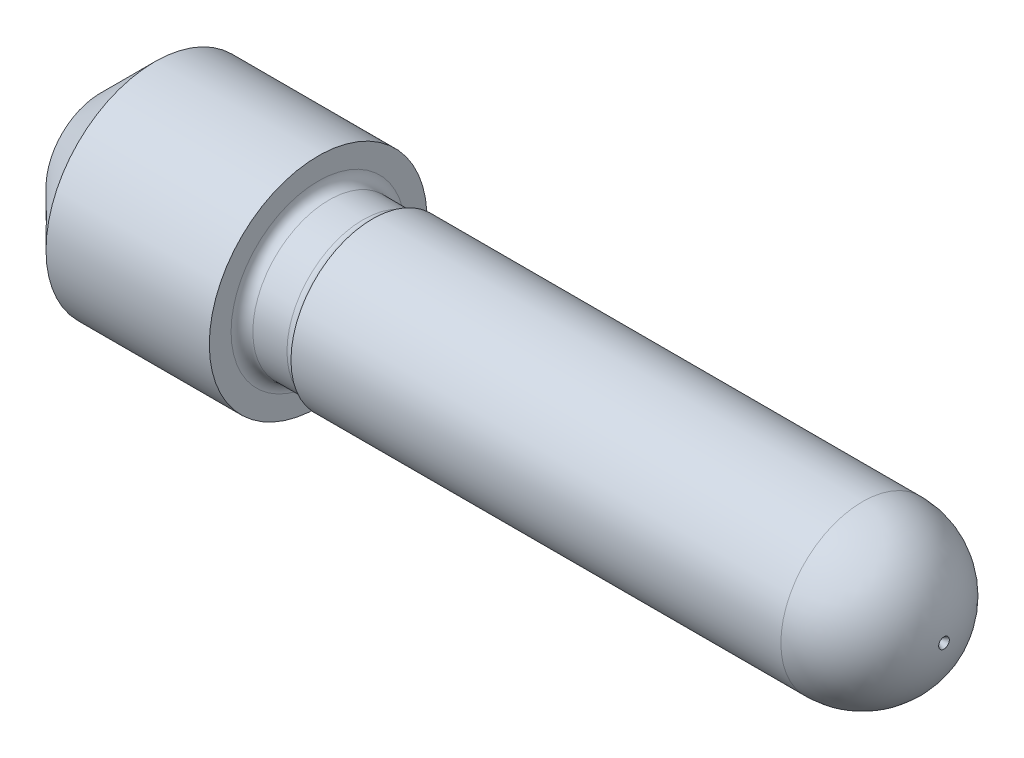
ISO-10303-21;
HEADER;
FILE_DESCRIPTION(('STEP AP214'),'2;1');
FILE_NAME('part.step','',(''),(''),'','','');
FILE_SCHEMA(('AUTOMOTIVE_DESIGN { 1 0 10303 214 1 1 1 1 }'));
ENDSEC;
DATA;
#1=APPLICATION_CONTEXT('core data for automotive mechanical design processes');
#2=APPLICATION_PROTOCOL_DEFINITION('international standard','automotive_design',2000,#1);
#3=PRODUCT_CONTEXT('',#1,'mechanical');
#4=PRODUCT('Part','Part','',(#3));
#5=PRODUCT_RELATED_PRODUCT_CATEGORY('part','',(#4));
#6=PRODUCT_DEFINITION_FORMATION('','',#4);
#7=PRODUCT_DEFINITION_CONTEXT('part definition',#1,'design');
#8=PRODUCT_DEFINITION('design','',#6,#7);
#9=PRODUCT_DEFINITION_SHAPE('','',#8);
#10=(LENGTH_UNIT() NAMED_UNIT(*) SI_UNIT(.MILLI.,.METRE.));
#11=(NAMED_UNIT(*) PLANE_ANGLE_UNIT() SI_UNIT($,.RADIAN.));
#12=(NAMED_UNIT(*) SI_UNIT($,.STERADIAN.) SOLID_ANGLE_UNIT());
#13=UNCERTAINTY_MEASURE_WITH_UNIT(LENGTH_MEASURE(1.E-05),#10,'distance_accuracy_value','');
#14=(GEOMETRIC_REPRESENTATION_CONTEXT(3) GLOBAL_UNCERTAINTY_ASSIGNED_CONTEXT((#13)) GLOBAL_UNIT_ASSIGNED_CONTEXT((#10,
#11,#12)) REPRESENTATION_CONTEXT('',''));
#15=CARTESIAN_POINT('',(0.,0.,0.));
#16=DIRECTION('',(0.,0.,1.));
#17=DIRECTION('',(1.,0.,0.));
#18=AXIS2_PLACEMENT_3D('',#15,#16,#17);
#19=CARTESIAN_POINT('',(-4.0000000000191,0.,0.));
#20=DIRECTION('',(-1.,0.,0.));
#21=DIRECTION('',(0.,0.,1.));
#22=AXIS2_PLACEMENT_3D('',#19,#20,#21);
#23=CONICAL_SURFACE('',#22,0.100000000031741,0.523598775666574);
#24=CARTESIAN_POINT('',(-3.82679491934823,0.,0.));
#25=VERTEX_POINT('',#24);
#26=VERTEX_LOOP('',#25);
#27=FACE_BOUND('',#26,.T.);
#28=CARTESIAN_POINT('',(-4.0000000000191,0.,0.));
#29=DIRECTION('',(-1.,0.,0.));
#30=DIRECTION('',(0.,0.,1.));
#31=AXIS2_PLACEMENT_3D('',#28,#29,#30);
#32=CIRCLE('',#31,0.100000000031741);
#33=CARTESIAN_POINT('',(-4.0000000000191,0.,0.100000000031741));
#34=VERTEX_POINT('',#33);
#35=EDGE_CURVE('E58',#34,#34,#32,.T.);
#36=ORIENTED_EDGE('',*,*,#35,.T.);
#37=EDGE_LOOP('',(#36));
#38=FACE_BOUND('',#37,.T.);
#39=ADVANCED_FACE('F17',(#27,#38),#23,.F.);
#40=CARTESIAN_POINT('',(-4.,0.,0.));
#41=DIRECTION('',(1.,0.,0.));
#42=DIRECTION('',(0.,0.,-1.));
#43=AXIS2_PLACEMENT_3D('',#40,#41,#42);
#44=PLANE('',#43);
#45=ORIENTED_EDGE('',*,*,#35,.F.);
#46=EDGE_LOOP('',(#45));
#47=FACE_BOUND('',#46,.T.);
#48=CARTESIAN_POINT('',(-4.0000000000191,0.,0.));
#49=DIRECTION('',(1.,0.,0.));
#50=DIRECTION('',(0.,0.,-1.));
#51=AXIS2_PLACEMENT_3D('',#48,#49,#50);
#52=CIRCLE('',#51,0.999999999976353);
#53=CARTESIAN_POINT('',(-4.0000000000191,0.,-0.999999999976353));
#54=VERTEX_POINT('',#53);
#55=EDGE_CURVE('E60',#54,#54,#52,.T.);
#56=ORIENTED_EDGE('',*,*,#55,.F.);
#57=EDGE_LOOP('',(#56));
#58=FACE_BOUND('',#57,.T.);
#59=ADVANCED_FACE('F55',(#47,#58),#44,.F.);
#60=CARTESIAN_POINT('',(-2.9999999999859,0.,0.));
#61=DIRECTION('',(1.,0.,0.));
#62=DIRECTION('',(0.,0.,-1.));
#63=AXIS2_PLACEMENT_3D('',#60,#61,#62);
#64=CONICAL_SURFACE('',#63,1.99999999995271,0.785398163369027);
#65=ORIENTED_EDGE('',*,*,#55,.T.);
#66=EDGE_LOOP('',(#65));
#67=FACE_BOUND('',#66,.T.);
#68=CARTESIAN_POINT('',(-3.,0.,0.));
#69=DIRECTION('',(-1.,0.,0.));
#70=DIRECTION('',(0.,0.,1.));
#71=AXIS2_PLACEMENT_3D('',#68,#69,#70);
#72=CIRCLE('',#71,2.);
#73=CARTESIAN_POINT('',(-3.,0.,2.));
#74=VERTEX_POINT('',#73);
#75=EDGE_CURVE('E63',#74,#74,#72,.F.);
#76=ORIENTED_EDGE('',*,*,#75,.F.);
#77=EDGE_LOOP('',(#76));
#78=FACE_BOUND('',#77,.T.);
#79=ADVANCED_FACE('F207',(#67,#78),#64,.T.);
#80=CARTESIAN_POINT('',(0.,0.,0.));
#81=DIRECTION('',(-1.,0.,0.));
#82=DIRECTION('',(0.,0.,1.));
#83=AXIS2_PLACEMENT_3D('',#80,#81,#82);
#84=CYLINDRICAL_SURFACE('',#83,2.);
#85=CARTESIAN_POINT('',(0.,0.,0.));
#86=DIRECTION('',(-1.,0.,0.));
#87=DIRECTION('',(0.,0.,1.));
#88=AXIS2_PLACEMENT_3D('',#85,#86,#87);
#89=CIRCLE('',#88,2.);
#90=CARTESIAN_POINT('',(0.,0.,2.));
#91=VERTEX_POINT('',#90);
#92=EDGE_CURVE('E113',#91,#91,#89,.T.);
#93=ORIENTED_EDGE('',*,*,#92,.T.);
#94=EDGE_LOOP('',(#93));
#95=FACE_BOUND('',#94,.T.);
#96=ORIENTED_EDGE('',*,*,#75,.T.);
#97=EDGE_LOOP('',(#96));
#98=FACE_BOUND('',#97,.T.);
#99=ADVANCED_FACE('F199',(#95,#98),#84,.T.);
#100=CARTESIAN_POINT('',(0.,7.,0.));
#101=DIRECTION('',(-1.,0.,0.));
#102=DIRECTION('',(0.,0.,1.));
#103=AXIS2_PLACEMENT_3D('',#100,#101,#102);
#104=PLANE('',#103);
#105=CARTESIAN_POINT('',(0.,0.,0.));
#106=DIRECTION('',(1.,0.,0.));
#107=DIRECTION('',(0.,0.,1.));
#108=AXIS2_PLACEMENT_3D('',#105,#106,#107);
#109=CIRCLE('',#108,1.6);
#110=CARTESIAN_POINT('',(0.,0.,1.6));
#111=VERTEX_POINT('',#110);
#112=CARTESIAN_POINT('',(0.,0.,-1.6));
#113=VERTEX_POINT('',#112);
#114=EDGE_CURVE('E48',#111,#113,#109,.T.);
#115=ORIENTED_EDGE('',*,*,#114,.F.);
#116=CARTESIAN_POINT('',(0.,0.,0.));
#117=DIRECTION('',(1.,0.,0.));
#118=DIRECTION('',(0.,0.,-1.));
#119=AXIS2_PLACEMENT_3D('',#116,#117,#118);
#120=CIRCLE('',#119,1.6);
#121=EDGE_CURVE('E69',#111,#113,#120,.F.);
#122=ORIENTED_EDGE('',*,*,#121,.T.);
#123=EDGE_LOOP('',(#115,#122));
#124=FACE_BOUND('',#123,.T.);
#125=ORIENTED_EDGE('',*,*,#92,.F.);
#126=EDGE_LOOP('',(#125));
#127=FACE_BOUND('',#126,.T.);
#128=ADVANCED_FACE('F84',(#124,#127),#104,.F.);
#129=CARTESIAN_POINT('',(0.2,0.,0.));
#130=DIRECTION('',(1.,0.,0.));
#131=DIRECTION('',(0.,0.,-1.));
#132=AXIS2_PLACEMENT_3D('',#129,#130,#131);
#133=TOROIDAL_SURFACE('',#132,1.6,0.2);
#134=ORIENTED_EDGE('',*,*,#114,.T.);
#135=ORIENTED_EDGE('',*,*,#121,.F.);
#136=EDGE_LOOP('',(#134,#135));
#137=FACE_BOUND('',#136,.T.);
#138=CARTESIAN_POINT('',(0.199999999999999,0.,0.));
#139=DIRECTION('',(-1.,0.,0.));
#140=DIRECTION('',(0.,0.,1.));
#141=AXIS2_PLACEMENT_3D('',#138,#139,#140);
#142=CIRCLE('',#141,1.4);
#143=CARTESIAN_POINT('',(0.199999999999999,0.,1.4));
#144=VERTEX_POINT('',#143);
#145=EDGE_CURVE('E91',#144,#144,#142,.F.);
#146=ORIENTED_EDGE('',*,*,#145,.F.);
#147=EDGE_LOOP('',(#146));
#148=FACE_BOUND('',#147,.T.);
#149=ADVANCED_FACE('F72',(#137,#148),#133,.F.);
#150=CARTESIAN_POINT('',(50.,0.,0.));
#151=DIRECTION('',(-1.,0.,0.));
#152=DIRECTION('',(0.,0.,1.));
#153=AXIS2_PLACEMENT_3D('',#150,#151,#152);
#154=CYLINDRICAL_SURFACE('',#153,1.4);
#155=CARTESIAN_POINT('',(0.8267949192431,0.,0.));
#156=DIRECTION('',(1.,0.,0.));
#157=DIRECTION('',(0.,0.,-1.));
#158=AXIS2_PLACEMENT_3D('',#155,#156,#157);
#159=CIRCLE('',#158,1.4);
#160=CARTESIAN_POINT('',(0.8267949192431,0.,-1.4));
#161=VERTEX_POINT('',#160);
#162=EDGE_CURVE('E117',#161,#161,#159,.F.);
#163=ORIENTED_EDGE('',*,*,#162,.T.);
#164=EDGE_LOOP('',(#163));
#165=FACE_BOUND('',#164,.T.);
#166=ORIENTED_EDGE('',*,*,#145,.T.);
#167=EDGE_LOOP('',(#166));
#168=FACE_BOUND('',#167,.T.);
#169=ADVANCED_FACE('F83',(#165,#168),#154,.T.);
#170=CARTESIAN_POINT('',(11.4967857900865,0.,0.));
#171=DIRECTION('',(1.,0.,0.));
#172=DIRECTION('',(0.,0.,-1.));
#173=AXIS2_PLACEMENT_3D('',#170,#171,#172);
#174=CONICAL_SURFACE('',#173,0.0981442750003225,0.523598774587516);
#175=CARTESIAN_POINT('',(11.3267949192277,0.,0.));
#176=VERTEX_POINT('',#175);
#177=VERTEX_LOOP('',#176);
#178=FACE_BOUND('',#177,.T.);
#179=CARTESIAN_POINT('',(11.4967857900865,0.,0.));
#180=DIRECTION('',(1.,0.,0.));
#181=DIRECTION('',(0.,0.,-1.));
#182=AXIS2_PLACEMENT_3D('',#179,#180,#181);
#183=CIRCLE('',#182,0.0981442750003225);
#184=CARTESIAN_POINT('',(11.4967857900865,0.,-0.0981442750003225));
#185=VERTEX_POINT('',#184);
#186=EDGE_CURVE('E114',#185,#185,#183,.F.);
#187=ORIENTED_EDGE('',*,*,#186,.F.);
#188=EDGE_LOOP('',(#187));
#189=FACE_BOUND('',#188,.T.);
#190=ADVANCED_FACE('F143',(#178,#189),#174,.F.);
#191=CARTESIAN_POINT('',(10.,0.,0.));
#192=DIRECTION('',(0.,-1.,0.));
#193=DIRECTION('',(0.,0.,-1.));
#194=AXIS2_PLACEMENT_3D('',#191,#192,#193);
#195=SPHERICAL_SURFACE('',#194,1.5);
#196=CARTESIAN_POINT('',(10.,0.,0.));
#197=DIRECTION('',(-1.,0.,0.));
#198=DIRECTION('',(0.,0.,1.));
#199=AXIS2_PLACEMENT_3D('',#196,#197,#198);
#200=CIRCLE('',#199,1.5);
#201=CARTESIAN_POINT('',(10.,-1.5,0.));
#202=VERTEX_POINT('',#201);
#203=CARTESIAN_POINT('',(10.,1.5,0.));
#204=VERTEX_POINT('',#203);
#205=EDGE_CURVE('E116',#202,#204,#200,.T.);
#206=ORIENTED_EDGE('',*,*,#205,.F.);
#207=CARTESIAN_POINT('',(10.,0.,0.));
#208=DIRECTION('',(-1.,0.,0.));
#209=DIRECTION('',(0.,0.,1.));
#210=AXIS2_PLACEMENT_3D('',#207,#208,#209);
#211=CIRCLE('',#210,1.5);
#212=EDGE_CURVE('E28',#204,#202,#211,.T.);
#213=ORIENTED_EDGE('',*,*,#212,.F.);
#214=EDGE_LOOP('',(#206,#213));
#215=FACE_BOUND('',#214,.T.);
#216=ORIENTED_EDGE('',*,*,#186,.T.);
#217=EDGE_LOOP('',(#216));
#218=FACE_BOUND('',#217,.T.);
#219=ADVANCED_FACE('F139',(#215,#218),#195,.T.);
#220=CARTESIAN_POINT('',(0.8267949192431,0.,0.));
#221=DIRECTION('',(1.,0.,0.));
#222=DIRECTION('',(0.,0.,-1.));
#223=AXIS2_PLACEMENT_3D('',#220,#221,#222);
#224=TOROIDAL_SURFACE('',#223,1.6,0.2);
#225=ORIENTED_EDGE('',*,*,#162,.F.);
#226=EDGE_LOOP('',(#225));
#227=FACE_BOUND('',#226,.T.);
#228=CARTESIAN_POINT('',(1.,0.,0.));
#229=DIRECTION('',(-1.,0.,0.));
#230=DIRECTION('',(0.,0.,1.));
#231=AXIS2_PLACEMENT_3D('',#228,#229,#230);
#232=CIRCLE('',#231,1.5);
#233=CARTESIAN_POINT('',(1.,0.,1.5));
#234=VERTEX_POINT('',#233);
#235=EDGE_CURVE('E11',#234,#234,#232,.F.);
#236=ORIENTED_EDGE('',*,*,#235,.F.);
#237=EDGE_LOOP('',(#236));
#238=FACE_BOUND('',#237,.T.);
#239=ADVANCED_FACE('F142',(#227,#238),#224,.F.);
#240=CARTESIAN_POINT('',(11.5,0.,0.));
#241=DIRECTION('',(-1.,0.,0.));
#242=DIRECTION('',(0.,0.,1.));
#243=AXIS2_PLACEMENT_3D('',#240,#241,#242);
#244=CYLINDRICAL_SURFACE('',#243,1.5);
#245=ORIENTED_EDGE('',*,*,#212,.T.);
#246=ORIENTED_EDGE('',*,*,#205,.T.);
#247=EDGE_LOOP('',(#245,#246));
#248=FACE_BOUND('',#247,.T.);
#249=ORIENTED_EDGE('',*,*,#235,.T.);
#250=EDGE_LOOP('',(#249));
#251=FACE_BOUND('',#250,.T.);
#252=ADVANCED_FACE('F137',(#248,#251),#244,.T.);
#253=CLOSED_SHELL('',(#39,#59,#79,#99,#128,#149,#169,#190,#219,#239,#252));
#254=MANIFOLD_SOLID_BREP('B1',#253);
#255=ADVANCED_BREP_SHAPE_REPRESENTATION('',(#18,#254),#14);
#256=SHAPE_DEFINITION_REPRESENTATION(#9,#255);
ENDSEC;
END-ISO-10303-21;
